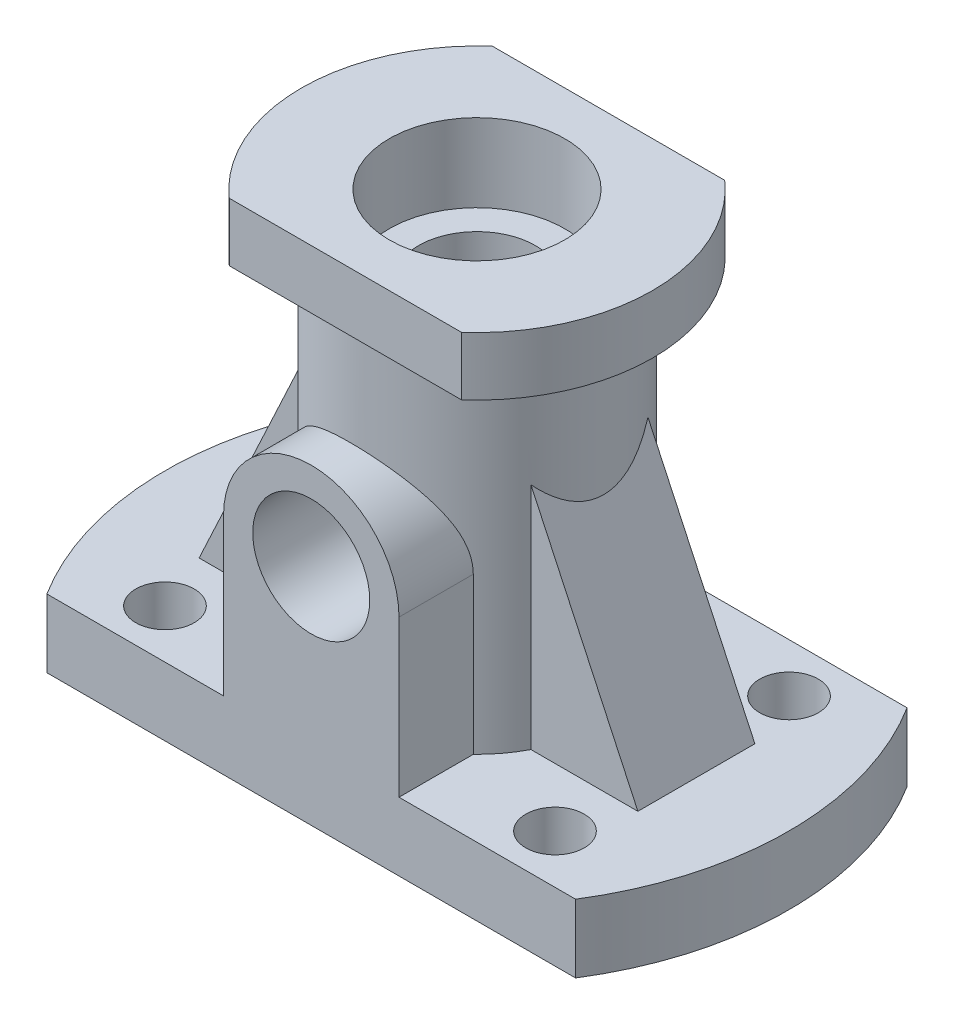
ISO-10303-21;
HEADER;
FILE_DESCRIPTION(('STEP AP214'),'2;1');
FILE_NAME('part.step','',(''),(''),'','','');
FILE_SCHEMA(('AUTOMOTIVE_DESIGN { 1 0 10303 214 1 1 1 1 }'));
ENDSEC;
DATA;
#1=APPLICATION_CONTEXT('core data for automotive mechanical design processes');
#2=APPLICATION_PROTOCOL_DEFINITION('international standard','automotive_design',2000,#1);
#3=PRODUCT_CONTEXT('',#1,'mechanical');
#4=PRODUCT('Part','Part','',(#3));
#5=PRODUCT_RELATED_PRODUCT_CATEGORY('part','',(#4));
#6=PRODUCT_DEFINITION_FORMATION('','',#4);
#7=PRODUCT_DEFINITION_CONTEXT('part definition',#1,'design');
#8=PRODUCT_DEFINITION('design','',#6,#7);
#9=PRODUCT_DEFINITION_SHAPE('','',#8);
#10=(LENGTH_UNIT() NAMED_UNIT(*) SI_UNIT(.MILLI.,.METRE.));
#11=(NAMED_UNIT(*) PLANE_ANGLE_UNIT() SI_UNIT($,.RADIAN.));
#12=(NAMED_UNIT(*) SI_UNIT($,.STERADIAN.) SOLID_ANGLE_UNIT());
#13=UNCERTAINTY_MEASURE_WITH_UNIT(LENGTH_MEASURE(1.E-05),#10,'distance_accuracy_value','');
#14=(GEOMETRIC_REPRESENTATION_CONTEXT(3) GLOBAL_UNCERTAINTY_ASSIGNED_CONTEXT((#13)) GLOBAL_UNIT_ASSIGNED_CONTEXT((#10,
#11,#12)) REPRESENTATION_CONTEXT('',''));
#15=CARTESIAN_POINT('',(0.,0.,0.));
#16=DIRECTION('',(0.,0.,1.));
#17=DIRECTION('',(1.,0.,0.));
#18=AXIS2_PLACEMENT_3D('',#15,#16,#17);
#19=CARTESIAN_POINT('',(0.,7.,0.));
#20=DIRECTION('',(0.,1.,0.));
#21=DIRECTION('',(0.,0.,1.));
#22=AXIS2_PLACEMENT_3D('',#19,#20,#21);
#23=PLANE('',#22);
#24=CARTESIAN_POINT('',(20.,7.,-12.));
#25=DIRECTION('',(0.,1.,0.));
#26=DIRECTION('',(0.,0.,-1.));
#27=AXIS2_PLACEMENT_3D('',#24,#25,#26);
#28=CIRCLE('',#27,3.);
#29=CARTESIAN_POINT('',(20.,7.,-15.));
#30=VERTEX_POINT('',#29);
#31=EDGE_CURVE('E376',#30,#30,#28,.T.);
#32=ORIENTED_EDGE('',*,*,#31,.F.);
#33=EDGE_LOOP('',(#32));
#34=FACE_BOUND('',#33,.T.);
#35=CARTESIAN_POINT('',(-20.,7.,-12.));
#36=DIRECTION('',(0.,-1.,0.));
#37=DIRECTION('',(0.,0.,-1.));
#38=AXIS2_PLACEMENT_3D('',#35,#36,#37);
#39=CIRCLE('',#38,3.);
#40=CARTESIAN_POINT('',(-20.,7.,-15.));
#41=VERTEX_POINT('',#40);
#42=EDGE_CURVE('E702',#41,#41,#39,.T.);
#43=ORIENTED_EDGE('',*,*,#42,.T.);
#44=EDGE_LOOP('',(#43));
#45=FACE_BOUND('',#44,.T.);
#46=CARTESIAN_POINT('',(20.,7.,12.));
#47=DIRECTION('',(0.,-1.,0.));
#48=DIRECTION('',(0.,0.,1.));
#49=AXIS2_PLACEMENT_3D('',#46,#47,#48);
#50=CIRCLE('',#49,3.);
#51=CARTESIAN_POINT('',(20.,7.,15.));
#52=VERTEX_POINT('',#51);
#53=EDGE_CURVE('E463',#52,#52,#50,.T.);
#54=ORIENTED_EDGE('',*,*,#53,.T.);
#55=EDGE_LOOP('',(#54));
#56=FACE_BOUND('',#55,.T.);
#57=CARTESIAN_POINT('',(-20.,7.,12.));
#58=DIRECTION('',(0.,1.,0.));
#59=DIRECTION('',(0.,0.,1.));
#60=AXIS2_PLACEMENT_3D('',#57,#58,#59);
#61=CIRCLE('',#60,3.);
#62=CARTESIAN_POINT('',(-20.,7.,15.));
#63=VERTEX_POINT('',#62);
#64=EDGE_CURVE('E458',#63,#63,#61,.T.);
#65=ORIENTED_EDGE('',*,*,#64,.F.);
#66=EDGE_LOOP('',(#65));
#67=FACE_BOUND('',#66,.T.);
#68=CARTESIAN_POINT('',(0.,7.,0.));
#69=DIRECTION('',(0.,1.,0.));
#70=DIRECTION('',(0.,0.,1.));
#71=AXIS2_PLACEMENT_3D('',#68,#69,#70);
#72=CIRCLE('',#71,13.);
#73=CARTESIAN_POINT('',(11.5325625946708,7.,-6.));
#74=VERTEX_POINT('',#73);
#75=CARTESIAN_POINT('',(-11.5325625946708,7.,-6.));
#76=VERTEX_POINT('',#75);
#77=EDGE_CURVE('E372',#74,#76,#72,.T.);
#78=ORIENTED_EDGE('',*,*,#77,.F.);
#79=DIRECTION('',(-1.,0.,0.));
#80=VECTOR('',#79,1.);
#81=CARTESIAN_POINT('',(22.5,7.,-6.));
#82=LINE('',#81,#80);
#83=CARTESIAN_POINT('',(22.5,7.,-6.));
#84=VERTEX_POINT('',#83);
#85=EDGE_CURVE('E184',#84,#74,#82,.T.);
#86=ORIENTED_EDGE('',*,*,#85,.F.);
#87=DIRECTION('',(0.,0.,1.));
#88=VECTOR('',#87,1.);
#89=CARTESIAN_POINT('',(22.5,7.,-6.));
#90=LINE('',#89,#88);
#91=CARTESIAN_POINT('',(22.5,7.,6.));
#92=VERTEX_POINT('',#91);
#93=EDGE_CURVE('E169',#84,#92,#90,.T.);
#94=ORIENTED_EDGE('',*,*,#93,.T.);
#95=DIRECTION('',(-1.,0.,0.));
#96=VECTOR('',#95,1.);
#97=CARTESIAN_POINT('',(22.5,7.,6.));
#98=LINE('',#97,#96);
#99=CARTESIAN_POINT('',(11.5325625946708,7.,6.));
#100=VERTEX_POINT('',#99);
#101=EDGE_CURVE('E173',#92,#100,#98,.T.);
#102=ORIENTED_EDGE('',*,*,#101,.T.);
#103=CARTESIAN_POINT('',(9.,7.,9.38083151964686));
#104=VERTEX_POINT('',#103);
#105=EDGE_CURVE('E369',#104,#100,#72,.T.);
#106=ORIENTED_EDGE('',*,*,#105,.F.);
#107=DIRECTION('',(0.,0.,1.));
#108=VECTOR('',#107,1.);
#109=CARTESIAN_POINT('',(9.,7.,-17.002));
#110=LINE('',#109,#108);
#111=CARTESIAN_POINT('',(9.,7.,17.));
#112=VERTEX_POINT('',#111);
#113=EDGE_CURVE('E223',#104,#112,#110,.T.);
#114=ORIENTED_EDGE('',*,*,#113,.T.);
#115=DIRECTION('',(1.,0.,0.));
#116=VECTOR('',#115,1.);
#117=CARTESIAN_POINT('',(-27.1108834234519,7.,17.));
#118=LINE('',#117,#116);
#119=CARTESIAN_POINT('',(27.1108834234519,7.,17.));
#120=VERTEX_POINT('',#119);
#121=EDGE_CURVE('E468',#112,#120,#118,.T.);
#122=ORIENTED_EDGE('',*,*,#121,.T.);
#123=CARTESIAN_POINT('',(0.,7.,0.));
#124=DIRECTION('',(0.,1.,0.));
#125=DIRECTION('',(0.,0.,1.));
#126=AXIS2_PLACEMENT_3D('',#123,#124,#125);
#127=CIRCLE('',#126,32.);
#128=CARTESIAN_POINT('',(27.1108834234519,7.,-17.));
#129=VERTEX_POINT('',#128);
#130=EDGE_CURVE('E342',#120,#129,#127,.T.);
#131=ORIENTED_EDGE('',*,*,#130,.T.);
#132=DIRECTION('',(-1.,0.,0.));
#133=VECTOR('',#132,1.);
#134=CARTESIAN_POINT('',(-27.1108834234519,7.,-17.));
#135=LINE('',#134,#133);
#136=CARTESIAN_POINT('',(-27.1108834234519,7.,-17.));
#137=VERTEX_POINT('',#136);
#138=EDGE_CURVE('E355',#129,#137,#135,.T.);
#139=ORIENTED_EDGE('',*,*,#138,.T.);
#140=CARTESIAN_POINT('',(0.,7.,0.));
#141=DIRECTION('',(0.,1.,0.));
#142=DIRECTION('',(0.,0.,1.));
#143=AXIS2_PLACEMENT_3D('',#140,#141,#142);
#144=CIRCLE('',#143,32.);
#145=CARTESIAN_POINT('',(-27.1108834234519,7.,17.));
#146=VERTEX_POINT('',#145);
#147=EDGE_CURVE('E348',#137,#146,#144,.T.);
#148=ORIENTED_EDGE('',*,*,#147,.T.);
#149=CARTESIAN_POINT('',(-9.,7.,17.));
#150=VERTEX_POINT('',#149);
#151=EDGE_CURVE('E469',#146,#150,#118,.T.);
#152=ORIENTED_EDGE('',*,*,#151,.T.);
#153=DIRECTION('',(0.,0.,-1.));
#154=VECTOR('',#153,1.);
#155=CARTESIAN_POINT('',(-9.,7.,-17.002));
#156=LINE('',#155,#154);
#157=CARTESIAN_POINT('',(-9.,7.,9.38083151964686));
#158=VERTEX_POINT('',#157);
#159=EDGE_CURVE('E227',#150,#158,#156,.T.);
#160=ORIENTED_EDGE('',*,*,#159,.T.);
#161=CARTESIAN_POINT('',(-11.5325625946708,7.,6.));
#162=VERTEX_POINT('',#161);
#163=EDGE_CURVE('E374',#162,#158,#72,.T.);
#164=ORIENTED_EDGE('',*,*,#163,.F.);
#165=DIRECTION('',(1.,0.,0.));
#166=VECTOR('',#165,1.);
#167=CARTESIAN_POINT('',(-22.5,7.,6.));
#168=LINE('',#167,#166);
#169=CARTESIAN_POINT('',(-22.5,7.,6.));
#170=VERTEX_POINT('',#169);
#171=EDGE_CURVE('E60',#170,#162,#168,.T.);
#172=ORIENTED_EDGE('',*,*,#171,.F.);
#173=DIRECTION('',(0.,0.,1.));
#174=VECTOR('',#173,1.);
#175=CARTESIAN_POINT('',(-22.5,7.,-6.));
#176=LINE('',#175,#174);
#177=CARTESIAN_POINT('',(-22.5,7.,-6.));
#178=VERTEX_POINT('',#177);
#179=EDGE_CURVE('E197',#178,#170,#176,.T.);
#180=ORIENTED_EDGE('',*,*,#179,.F.);
#181=DIRECTION('',(1.,0.,0.));
#182=VECTOR('',#181,1.);
#183=CARTESIAN_POINT('',(-22.5,7.,-6.));
#184=LINE('',#183,#182);
#185=EDGE_CURVE('E194',#178,#76,#184,.T.);
#186=ORIENTED_EDGE('',*,*,#185,.T.);
#187=EDGE_LOOP('',(#78,#86,#94,#102,#106,#114,#122,#131,#139,#148,#152,#160,#164,#172,#180,#186));
#188=FACE_BOUND('',#187,.T.);
#189=ADVANCED_FACE('F37',(#34,#45,#56,#67,#188),#23,.T.);
#190=CARTESIAN_POINT('',(0.,42.,0.));
#191=DIRECTION('',(0.,-1.,0.));
#192=DIRECTION('',(0.,0.,-1.));
#193=AXIS2_PLACEMENT_3D('',#190,#191,#192);
#194=CYLINDRICAL_SURFACE('',#193,13.);
#195=CARTESIAN_POINT('',(0.,42.,0.));
#196=DIRECTION('',(0.,1.,0.));
#197=DIRECTION('',(0.,0.,1.));
#198=AXIS2_PLACEMENT_3D('',#195,#196,#197);
#199=CIRCLE('',#198,13.);
#200=CARTESIAN_POINT('',(0.,42.,13.));
#201=VERTEX_POINT('',#200);
#202=EDGE_CURVE('E371',#201,#201,#199,.T.);
#203=ORIENTED_EDGE('',*,*,#202,.F.);
#204=EDGE_LOOP('',(#203));
#205=FACE_BOUND('',#204,.T.);
#206=DIRECTION('',(0.,-1.,0.));
#207=VECTOR('',#206,1.);
#208=CARTESIAN_POINT('',(11.5325625946708,42.,-6.));
#209=LINE('',#208,#207);
#210=CARTESIAN_POINT('',(11.5325625946708,30.5197454159836,-6.));
#211=VERTEX_POINT('',#210);
#212=EDGE_CURVE('E11',#74,#211,#209,.F.);
#213=ORIENTED_EDGE('',*,*,#212,.F.);
#214=ORIENTED_EDGE('',*,*,#77,.T.);
#215=DIRECTION('',(0.,-1.,0.));
#216=VECTOR('',#215,1.);
#217=CARTESIAN_POINT('',(-11.5325625946708,42.,-6.));
#218=LINE('',#217,#216);
#219=CARTESIAN_POINT('',(-11.5325625946708,30.5197454159836,-6.));
#220=VERTEX_POINT('',#219);
#221=EDGE_CURVE('E363',#220,#76,#218,.T.);
#222=ORIENTED_EDGE('',*,*,#221,.F.);
#223=CARTESIAN_POINT('',(0.,55.2514057114645,0.));
#224=DIRECTION('',(-0.906307787036648,0.422618261740704,0.));
#225=DIRECTION('',(-0.422618261740704,-0.906307787036648,0.));
#226=AXIS2_PLACEMENT_3D('',#223,#224,#225);
#227=ELLIPSE('',#226,30.7606205809822,13.);
#228=CARTESIAN_POINT('',(-11.5325625946708,30.5197454159836,6.));
#229=VERTEX_POINT('',#228);
#230=EDGE_CURVE('E360',#220,#229,#227,.T.);
#231=ORIENTED_EDGE('',*,*,#230,.T.);
#232=DIRECTION('',(0.,-1.,0.));
#233=VECTOR('',#232,1.);
#234=CARTESIAN_POINT('',(-11.5325625946708,42.,6.));
#235=LINE('',#234,#233);
#236=EDGE_CURVE('E358',#229,#162,#235,.T.);
#237=ORIENTED_EDGE('',*,*,#236,.T.);
#238=ORIENTED_EDGE('',*,*,#163,.T.);
#239=DIRECTION('',(0.,-1.,0.));
#240=VECTOR('',#239,1.);
#241=CARTESIAN_POINT('',(-9.,42.,9.38083151964686));
#242=LINE('',#241,#240);
#243=CARTESIAN_POINT('',(-9.,23.,9.38083151964686));
#244=VERTEX_POINT('',#243);
#245=EDGE_CURVE('E222',#244,#158,#242,.T.);
#246=ORIENTED_EDGE('',*,*,#245,.F.);
#247=CARTESIAN_POINT('',(9.,23.,9.38083151964686));
#248=CARTESIAN_POINT('',(9.00000195551194,23.109281590863,9.3808257099244));
#249=CARTESIAN_POINT('',(8.99800899360825,23.2185439624175,9.38274213521519));
#250=CARTESIAN_POINT('',(8.9900579091309,23.4367797007814,9.3903622727786));
#251=CARTESIAN_POINT('',(8.98410024589008,23.5457530996018,9.39606554632351));
#252=CARTESIAN_POINT('',(8.96034474196165,23.87151493557,9.41874360903438));
#253=CARTESIAN_POINT('',(8.93666419500784,24.0875358163211,9.44128704880777));
#254=CARTESIAN_POINT('',(8.87447382886631,24.5131115491226,9.49976263371282));
#255=CARTESIAN_POINT('',(8.83612533575314,24.7227108484366,9.53554899145173));
#256=CARTESIAN_POINT('',(8.74530413131831,25.1364779137659,9.61891100850263));
#257=CARTESIAN_POINT('',(8.69282665967837,25.3406438236485,9.66649064076062));
#258=CARTESIAN_POINT('',(8.57490389625952,25.741234069921,9.77124281519534));
#259=CARTESIAN_POINT('',(8.50953777839024,25.9376973022298,9.82835647736648));
#260=CARTESIAN_POINT('',(8.36642586105673,26.32344087215,9.95046682567776));
#261=CARTESIAN_POINT('',(8.28868082966281,26.5127216545068,10.0154630226733));
#262=CARTESIAN_POINT('',(8.03734070978799,27.0703409407484,10.2199652818551));
#263=CARTESIAN_POINT('',(7.84592988373194,27.4274903208693,10.3687160605543));
#264=CARTESIAN_POINT('',(7.50863541089304,27.9674585322767,10.6133962963535));
#265=CARTESIAN_POINT('',(7.3768357609505,28.1611015098971,10.7056204905726));
#266=CARTESIAN_POINT('',(7.09897520940021,28.5370710791971,10.8918538235021));
#267=CARTESIAN_POINT('',(6.95291328416346,28.7193968570826,10.9858630899399));
#268=CARTESIAN_POINT('',(6.64692711418784,29.0723095998355,11.1736572379947));
#269=CARTESIAN_POINT('',(6.48699586896819,29.2428905577114,11.2674419814545));
#270=CARTESIAN_POINT('',(6.15370949500606,29.5716546118136,11.4528698100124));
#271=CARTESIAN_POINT('',(5.98035451098951,29.7298378416669,11.5445129181863));
#272=CARTESIAN_POINT('',(5.59144218585637,30.0576554486902,11.73841164456));
#273=CARTESIAN_POINT('',(5.37359691648463,30.2249954744972,11.8399823297032));
#274=CARTESIAN_POINT('',(4.92100887547879,30.540541819655,12.0351321535615));
#275=CARTESIAN_POINT('',(4.68626308715378,30.6887447098312,12.1287098590041));
#276=CARTESIAN_POINT('',(4.20134449187813,30.9640643577582,12.3050870557945));
#277=CARTESIAN_POINT('',(3.95119487188303,31.0912117944038,12.3879021901926));
#278=CARTESIAN_POINT('',(3.43677745845613,31.322741565789,12.5403521593611));
#279=CARTESIAN_POINT('',(3.17251569031232,31.4271335209218,12.6099925623948));
#280=CARTESIAN_POINT('',(2.70356685284894,31.5868997161352,12.7174034752232));
#281=CARTESIAN_POINT('',(2.50160340717035,31.6479363713446,12.7587319257392));
#282=CARTESIAN_POINT('',(2.09233338300936,31.7559639035567,12.8321989831048));
#283=CARTESIAN_POINT('',(1.88502792696471,31.8029577054557,12.864339503589));
#284=CARTESIAN_POINT('',(1.46648324581181,31.8822726544217,12.9187435720911));
#285=CARTESIAN_POINT('',(1.255246582934,31.9146030324491,12.9410133337758));
#286=CARTESIAN_POINT('',(0.830166009123639,31.964184798963,12.9752181499993));
#287=CARTESIAN_POINT('',(0.616322010714029,31.9814356801075,12.9871528568202));
#288=CARTESIAN_POINT('',(0.187217722492278,32.0006199324661,13.0004273316533));
#289=CARTESIAN_POINT('',(-0.0280444627712335,32.0025247295307,13.0017473352587));
#290=CARTESIAN_POINT('',(-0.457949855893778,31.990913227742,12.9937101433514));
#291=CARTESIAN_POINT('',(-0.672593066057432,31.9773969863801,12.9843529876444));
#292=CARTESIAN_POINT('',(-1.09970273772063,31.9351396178258,12.9551722125125));
#293=CARTESIAN_POINT('',(-1.31216866187516,31.9063948203397,12.9353460699199));
#294=CARTESIAN_POINT('',(-1.73336379307757,31.834088038531,12.8856673119349));
#295=CARTESIAN_POINT('',(-1.94209299351823,31.7905260280116,12.8558146788157));
#296=CARTESIAN_POINT('',(-2.35003550559374,31.6902535141929,12.7874622703602));
#297=CARTESIAN_POINT('',(-2.54935689942799,31.6338451751435,12.749161768409));
#298=CARTESIAN_POINT('',(-2.94211247406124,31.5080264883626,12.6642945909378));
#299=CARTESIAN_POINT('',(-3.13554456047183,31.4386115765204,12.6177250140343));
#300=CARTESIAN_POINT('',(-3.51549356594056,31.2875264071346,12.5171848095962));
#301=CARTESIAN_POINT('',(-3.70201244829317,31.2058596627887,12.463216304076));
#302=CARTESIAN_POINT('',(-4.06753685818808,31.0309535585355,12.348758699626));
#303=CARTESIAN_POINT('',(-4.2465396376266,30.9377100142822,12.2882672440704));
#304=CARTESIAN_POINT('',(-4.61602158168553,30.7293099745617,12.1546344322415));
#305=CARTESIAN_POINT('',(-4.80553832809482,30.612868791531,12.0808351665865));
#306=CARTESIAN_POINT('',(-5.17398936059498,30.3674191605768,11.9276847196055));
#307=CARTESIAN_POINT('',(-5.35291904518244,30.2384053116922,11.8483311564275));
#308=CARTESIAN_POINT('',(-5.69981637027411,29.9685310181206,11.6854114245313));
#309=CARTESIAN_POINT('',(-5.86777534375116,29.8276614035297,11.6018420154326));
#310=CARTESIAN_POINT('',(-6.19224456106073,29.5348203980515,11.431957495225));
#311=CARTESIAN_POINT('',(-6.34875364651582,29.3828478869916,11.3456421075714));
#312=CARTESIAN_POINT('',(-6.6764136188107,29.0407777396719,11.1564898135338));
#313=CARTESIAN_POINT('',(-6.84532621916435,28.8486651871741,11.0534076129591));
#314=CARTESIAN_POINT('',(-7.16641572878552,28.4504979498017,10.8479870365356));
#315=CARTESIAN_POINT('',(-7.31858910957648,28.2444403401638,10.7456488217418));
#316=CARTESIAN_POINT('',(-7.60553643363537,27.8188830062757,10.5445009375273));
#317=CARTESIAN_POINT('',(-7.74031137228791,27.5993840520803,10.4456910664802));
#318=CARTESIAN_POINT('',(-7.99153913734129,27.1475513822524,10.2547649559516));
#319=CARTESIAN_POINT('',(-8.10799821776645,26.9152220843643,10.1626464374876));
#320=CARTESIAN_POINT('',(-8.37594883000304,26.3164415024092,9.94417772623478));
#321=CARTESIAN_POINT('',(-8.51515524828115,25.9418459879001,9.82423006095672));
#322=CARTESIAN_POINT('',(-8.68668936681556,25.3626069794905,9.67198425621953));
#323=CARTESIAN_POINT('',(-8.73761413561111,25.1668931133167,9.62588888888996));
#324=CARTESIAN_POINT('',(-8.82649441159561,24.7703763684949,9.54445516025221));
#325=CARTESIAN_POINT('',(-8.86445517899175,24.5695755894974,9.50911243664287));
#326=CARTESIAN_POINT('',(-8.93005649492109,24.142585050387,9.44755876816322));
#327=CARTESIAN_POINT('',(-8.95618093455732,23.9159561855554,9.42270895524074));
#328=CARTESIAN_POINT('',(-8.98241701261064,23.5738836364075,9.39767590358811));
#329=CARTESIAN_POINT('',(-8.98900405178583,23.4593269959357,9.39137160742606));
#330=CARTESIAN_POINT('',(-8.99779746245776,23.2298546139967,9.38294519204893));
#331=CARTESIAN_POINT('',(-9.00000238102187,23.1149387660754,9.38082445993493));
#332=CARTESIAN_POINT('',(-9.,23.,9.38083151964686));
#333=B_SPLINE_CURVE_WITH_KNOTS('',3,(#247,#248,#249,#250,#251,#252,#253,#254,#255,#256,#257,
#258,#259,#260,#261,#262,#263,#264,#265,#266,#267,#268,#269,#270,#271,#272,#273,#274,#275,#276,
#277,#278,#279,#280,#281,#282,#283,#284,#285,#286,#287,#288,#289,#290,#291,#292,#293,#294,#295,
#296,#297,#298,#299,#300,#301,#302,#303,#304,#305,#306,#307,#308,#309,#310,#311,#312,#313,#314,
#315,#316,#317,#318,#319,#320,#321,#322,#323,#324,#325,#326,#327,#328,#329,#330,#331,#332),
.UNSPECIFIED.,.F.,.F.,(4,2,2,2,2,2,2,2,2,2,2,2,2,2,2,2,2,2,2,2,2,2,2,2,2,2,2,2,2,2,2,2,2,2,2,2,
2,2,2,2,2,2,4),(0.,0.327772404152453,0.655506840648773,1.30980863104586,1.9571118806618,
2.60463349240515,3.24829484557937,3.89191627726453,5.18226157804349,5.93697645954376,
6.69174554815042,7.44689784568076,8.20204200278952,9.07948301190049,9.95708103172238,
10.8333888748605,11.7093255174423,12.3536499645513,12.9978401157488,13.6416241697261,
14.2854298826545,14.9304340745436,15.5754358617885,16.220593174203,16.8657516272622,
17.4970677330642,18.1286057890464,18.7599630971965,19.3915492726127,20.0939252077021,
20.7966042105069,21.499831788749,22.2031304139446,23.0296378155787,23.8563191050121,
24.6829530780913,25.5093041779424,26.755716357767,27.3773621908184,27.9987554874993,
28.685868850405,29.0304857002905,29.3752167920314),.UNSPECIFIED.);
#334=CARTESIAN_POINT('',(9.,23.,9.38083151964686));
#335=VERTEX_POINT('',#334);
#336=EDGE_CURVE('E230',#335,#244,#333,.T.);
#337=ORIENTED_EDGE('',*,*,#336,.F.);
#338=DIRECTION('',(0.,-1.,0.));
#339=VECTOR('',#338,1.);
#340=CARTESIAN_POINT('',(9.,42.,9.38083151964686));
#341=LINE('',#340,#339);
#342=EDGE_CURVE('E220',#104,#335,#341,.F.);
#343=ORIENTED_EDGE('',*,*,#342,.F.);
#344=ORIENTED_EDGE('',*,*,#105,.T.);
#345=DIRECTION('',(0.,-1.,0.));
#346=VECTOR('',#345,1.);
#347=CARTESIAN_POINT('',(11.5325625946708,42.,6.));
#348=LINE('',#347,#346);
#349=CARTESIAN_POINT('',(11.5325625946708,30.5197454159836,6.));
#350=VERTEX_POINT('',#349);
#351=EDGE_CURVE('E177',#100,#350,#348,.F.);
#352=ORIENTED_EDGE('',*,*,#351,.T.);
#353=CARTESIAN_POINT('',(0.,55.2514057114645,0.));
#354=DIRECTION('',(-0.906307787036648,-0.422618261740704,0.));
#355=DIRECTION('',(0.422618261740704,-0.906307787036648,0.));
#356=AXIS2_PLACEMENT_3D('',#353,#354,#355);
#357=ELLIPSE('',#356,30.7606205809822,13.);
#358=EDGE_CURVE('E45',#211,#350,#357,.T.);
#359=ORIENTED_EDGE('',*,*,#358,.F.);
#360=EDGE_LOOP('',(#213,#214,#222,#231,#237,#238,#246,#337,#343,#344,#352,#359));
#361=FACE_BOUND('',#360,.T.);
#362=ADVANCED_FACE('F282',(#205,#361),#194,.T.);
#363=CARTESIAN_POINT('',(0.,7.,0.));
#364=DIRECTION('',(0.,-1.,0.));
#365=DIRECTION('',(0.,0.,-1.));
#366=AXIS2_PLACEMENT_3D('',#363,#364,#365);
#367=CYLINDRICAL_SURFACE('',#366,32.);
#368=CARTESIAN_POINT('',(0.,0.,0.));
#369=DIRECTION('',(0.,1.,0.));
#370=DIRECTION('',(0.,0.,1.));
#371=AXIS2_PLACEMENT_3D('',#368,#369,#370);
#372=CIRCLE('',#371,32.);
#373=CARTESIAN_POINT('',(-27.1108834234519,0.,-17.));
#374=VERTEX_POINT('',#373);
#375=CARTESIAN_POINT('',(-27.1108834234519,0.,17.));
#376=VERTEX_POINT('',#375);
#377=EDGE_CURVE('E338',#374,#376,#372,.T.);
#378=ORIENTED_EDGE('',*,*,#377,.T.);
#379=DIRECTION('',(0.,-1.,0.));
#380=VECTOR('',#379,1.);
#381=CARTESIAN_POINT('',(-27.1108834234519,7.,17.));
#382=LINE('',#381,#380);
#383=EDGE_CURVE('E332',#146,#376,#382,.T.);
#384=ORIENTED_EDGE('',*,*,#383,.F.);
#385=ORIENTED_EDGE('',*,*,#147,.F.);
#386=DIRECTION('',(0.,-1.,0.));
#387=VECTOR('',#386,1.);
#388=CARTESIAN_POINT('',(-27.1108834234519,7.,-17.));
#389=LINE('',#388,#387);
#390=EDGE_CURVE('E352',#137,#374,#389,.T.);
#391=ORIENTED_EDGE('',*,*,#390,.T.);
#392=EDGE_LOOP('',(#378,#384,#385,#391));
#393=FACE_BOUND('',#392,.T.);
#394=ADVANCED_FACE('F39',(#393),#367,.T.);
#395=CARTESIAN_POINT('',(-27.1108834234519,7.,17.));
#396=DIRECTION('',(0.,0.,-1.));
#397=DIRECTION('',(-1.,0.,0.));
#398=AXIS2_PLACEMENT_3D('',#395,#396,#397);
#399=PLANE('',#398);
#400=CARTESIAN_POINT('',(0.,23.,17.));
#401=DIRECTION('',(0.,0.,1.));
#402=DIRECTION('',(1.,0.,0.));
#403=AXIS2_PLACEMENT_3D('',#400,#401,#402);
#404=CIRCLE('',#403,6.);
#405=CARTESIAN_POINT('',(6.,23.,17.));
#406=VERTEX_POINT('',#405);
#407=EDGE_CURVE('E203',#406,#406,#404,.T.);
#408=ORIENTED_EDGE('',*,*,#407,.F.);
#409=EDGE_LOOP('',(#408));
#410=FACE_BOUND('',#409,.T.);
#411=DIRECTION('',(1.,0.,0.));
#412=VECTOR('',#411,1.);
#413=CARTESIAN_POINT('',(-27.1108834234519,0.,17.));
#414=LINE('',#413,#412);
#415=CARTESIAN_POINT('',(27.1108834234519,0.,17.));
#416=VERTEX_POINT('',#415);
#417=EDGE_CURVE('E326',#376,#416,#414,.T.);
#418=ORIENTED_EDGE('',*,*,#417,.T.);
#419=DIRECTION('',(0.,-1.,0.));
#420=VECTOR('',#419,1.);
#421=CARTESIAN_POINT('',(27.1108834234519,7.,17.));
#422=LINE('',#421,#420);
#423=EDGE_CURVE('E329',#120,#416,#422,.T.);
#424=ORIENTED_EDGE('',*,*,#423,.F.);
#425=ORIENTED_EDGE('',*,*,#121,.F.);
#426=DIRECTION('',(0.,1.,0.));
#427=VECTOR('',#426,1.);
#428=CARTESIAN_POINT('',(9.,0.,17.));
#429=LINE('',#428,#427);
#430=CARTESIAN_POINT('',(9.,23.,17.));
#431=VERTEX_POINT('',#430);
#432=EDGE_CURVE('E211',#112,#431,#429,.T.);
#433=ORIENTED_EDGE('',*,*,#432,.T.);
#434=CARTESIAN_POINT('',(0.,23.,17.));
#435=DIRECTION('',(0.,0.,1.));
#436=DIRECTION('',(1.,0.,0.));
#437=AXIS2_PLACEMENT_3D('',#434,#435,#436);
#438=CIRCLE('',#437,9.);
#439=CARTESIAN_POINT('',(-9.,23.,17.));
#440=VERTEX_POINT('',#439);
#441=EDGE_CURVE('E207',#431,#440,#438,.T.);
#442=ORIENTED_EDGE('',*,*,#441,.T.);
#443=DIRECTION('',(0.,-1.,0.));
#444=VECTOR('',#443,1.);
#445=CARTESIAN_POINT('',(-9.,23.,17.));
#446=LINE('',#445,#444);
#447=EDGE_CURVE('E208',#440,#150,#446,.T.);
#448=ORIENTED_EDGE('',*,*,#447,.T.);
#449=ORIENTED_EDGE('',*,*,#151,.F.);
#450=ORIENTED_EDGE('',*,*,#383,.T.);
#451=EDGE_LOOP('',(#418,#424,#425,#433,#442,#448,#449,#450));
#452=FACE_BOUND('',#451,.T.);
#453=ADVANCED_FACE('F314',(#410,#452),#399,.F.);
#454=CARTESIAN_POINT('',(0.,7.,0.));
#455=DIRECTION('',(0.,-1.,0.));
#456=DIRECTION('',(0.,0.,-1.));
#457=AXIS2_PLACEMENT_3D('',#454,#455,#456);
#458=CYLINDRICAL_SURFACE('',#457,32.);
#459=CARTESIAN_POINT('',(0.,0.,0.));
#460=DIRECTION('',(0.,1.,0.));
#461=DIRECTION('',(0.,0.,1.));
#462=AXIS2_PLACEMENT_3D('',#459,#460,#461);
#463=CIRCLE('',#462,32.);
#464=CARTESIAN_POINT('',(27.1108834234519,0.,-17.));
#465=VERTEX_POINT('',#464);
#466=EDGE_CURVE('E337',#416,#465,#463,.T.);
#467=ORIENTED_EDGE('',*,*,#466,.T.);
#468=DIRECTION('',(0.,-1.,0.));
#469=VECTOR('',#468,1.);
#470=CARTESIAN_POINT('',(27.1108834234519,7.,-17.));
#471=LINE('',#470,#469);
#472=EDGE_CURVE('E343',#129,#465,#471,.T.);
#473=ORIENTED_EDGE('',*,*,#472,.F.);
#474=ORIENTED_EDGE('',*,*,#130,.F.);
#475=ORIENTED_EDGE('',*,*,#423,.T.);
#476=EDGE_LOOP('',(#467,#473,#474,#475));
#477=FACE_BOUND('',#476,.T.);
#478=ADVANCED_FACE('F311',(#477),#458,.T.);
#479=CARTESIAN_POINT('',(-27.1108834234519,7.,-17.));
#480=DIRECTION('',(0.,0.,1.));
#481=DIRECTION('',(1.,0.,0.));
#482=AXIS2_PLACEMENT_3D('',#479,#480,#481);
#483=PLANE('',#482);
#484=DIRECTION('',(-1.,0.,0.));
#485=VECTOR('',#484,1.);
#486=CARTESIAN_POINT('',(-27.1108834234519,0.,-17.));
#487=LINE('',#486,#485);
#488=EDGE_CURVE('E346',#465,#374,#487,.T.);
#489=ORIENTED_EDGE('',*,*,#488,.T.);
#490=ORIENTED_EDGE('',*,*,#390,.F.);
#491=ORIENTED_EDGE('',*,*,#138,.F.);
#492=ORIENTED_EDGE('',*,*,#472,.T.);
#493=EDGE_LOOP('',(#489,#490,#491,#492));
#494=FACE_BOUND('',#493,.T.);
#495=ADVANCED_FACE('F307',(#494),#483,.F.);
#496=CARTESIAN_POINT('',(0.,0.,0.));
#497=DIRECTION('',(0.,1.,0.));
#498=DIRECTION('',(0.,0.,1.));
#499=AXIS2_PLACEMENT_3D('',#496,#497,#498);
#500=PLANE('',#499);
#501=CARTESIAN_POINT('',(0.,0.,0.));
#502=DIRECTION('',(0.,1.,0.));
#503=DIRECTION('',(0.,0.,1.));
#504=AXIS2_PLACEMENT_3D('',#501,#502,#503);
#505=CIRCLE('',#504,6.);
#506=CARTESIAN_POINT('',(0.,0.,6.));
#507=VERTEX_POINT('',#506);
#508=EDGE_CURVE('E418',#507,#507,#505,.T.);
#509=ORIENTED_EDGE('',*,*,#508,.T.);
#510=EDGE_LOOP('',(#509));
#511=FACE_BOUND('',#510,.T.);
#512=CARTESIAN_POINT('',(20.,0.,-12.));
#513=DIRECTION('',(0.,1.,0.));
#514=DIRECTION('',(0.,0.,-1.));
#515=AXIS2_PLACEMENT_3D('',#512,#513,#514);
#516=CIRCLE('',#515,3.);
#517=CARTESIAN_POINT('',(20.,0.,-15.));
#518=VERTEX_POINT('',#517);
#519=EDGE_CURVE('E446',#518,#518,#516,.T.);
#520=ORIENTED_EDGE('',*,*,#519,.T.);
#521=EDGE_LOOP('',(#520));
#522=FACE_BOUND('',#521,.T.);
#523=CARTESIAN_POINT('',(-20.,0.,-12.));
#524=DIRECTION('',(0.,-1.,0.));
#525=DIRECTION('',(0.,0.,-1.));
#526=AXIS2_PLACEMENT_3D('',#523,#524,#525);
#527=CIRCLE('',#526,3.);
#528=CARTESIAN_POINT('',(-20.,0.,-15.));
#529=VERTEX_POINT('',#528);
#530=EDGE_CURVE('E450',#529,#529,#527,.T.);
#531=ORIENTED_EDGE('',*,*,#530,.F.);
#532=EDGE_LOOP('',(#531));
#533=FACE_BOUND('',#532,.T.);
#534=CARTESIAN_POINT('',(20.,0.,12.));
#535=DIRECTION('',(0.,-1.,0.));
#536=DIRECTION('',(0.,0.,1.));
#537=AXIS2_PLACEMENT_3D('',#534,#535,#536);
#538=CIRCLE('',#537,3.);
#539=CARTESIAN_POINT('',(20.,0.,15.));
#540=VERTEX_POINT('',#539);
#541=EDGE_CURVE('E454',#540,#540,#538,.T.);
#542=ORIENTED_EDGE('',*,*,#541,.F.);
#543=EDGE_LOOP('',(#542));
#544=FACE_BOUND('',#543,.T.);
#545=CARTESIAN_POINT('',(-20.,0.,12.));
#546=DIRECTION('',(0.,1.,0.));
#547=DIRECTION('',(0.,0.,1.));
#548=AXIS2_PLACEMENT_3D('',#545,#546,#547);
#549=CIRCLE('',#548,3.);
#550=CARTESIAN_POINT('',(-20.,0.,15.));
#551=VERTEX_POINT('',#550);
#552=EDGE_CURVE('E457',#551,#551,#549,.T.);
#553=ORIENTED_EDGE('',*,*,#552,.T.);
#554=EDGE_LOOP('',(#553));
#555=FACE_BOUND('',#554,.T.);
#556=ORIENTED_EDGE('',*,*,#377,.F.);
#557=ORIENTED_EDGE('',*,*,#488,.F.);
#558=ORIENTED_EDGE('',*,*,#466,.F.);
#559=ORIENTED_EDGE('',*,*,#417,.F.);
#560=EDGE_LOOP('',(#556,#557,#558,#559));
#561=FACE_BOUND('',#560,.T.);
#562=ADVANCED_FACE('F300',(#511,#522,#533,#544,#555,#561),#500,.F.);
#563=CARTESIAN_POINT('',(-20.,0.,12.));
#564=DIRECTION('',(0.,1.,0.));
#565=DIRECTION('',(0.,0.,1.));
#566=AXIS2_PLACEMENT_3D('',#563,#564,#565);
#567=CYLINDRICAL_SURFACE('',#566,3.);
#568=ORIENTED_EDGE('',*,*,#552,.F.);
#569=EDGE_LOOP('',(#568));
#570=FACE_BOUND('',#569,.T.);
#571=ORIENTED_EDGE('',*,*,#64,.T.);
#572=EDGE_LOOP('',(#571));
#573=FACE_BOUND('',#572,.T.);
#574=ADVANCED_FACE('F296',(#570,#573),#567,.F.);
#575=CARTESIAN_POINT('',(20.,0.,12.));
#576=DIRECTION('',(0.,1.,0.));
#577=DIRECTION('',(0.,0.,1.));
#578=AXIS2_PLACEMENT_3D('',#575,#576,#577);
#579=CYLINDRICAL_SURFACE('',#578,3.);
#580=ORIENTED_EDGE('',*,*,#541,.T.);
#581=EDGE_LOOP('',(#580));
#582=FACE_BOUND('',#581,.T.);
#583=ORIENTED_EDGE('',*,*,#53,.F.);
#584=EDGE_LOOP('',(#583));
#585=FACE_BOUND('',#584,.T.);
#586=ADVANCED_FACE('F292',(#582,#585),#579,.F.);
#587=CARTESIAN_POINT('',(-20.,0.,-12.));
#588=DIRECTION('',(0.,1.,0.));
#589=DIRECTION('',(0.,0.,1.));
#590=AXIS2_PLACEMENT_3D('',#587,#588,#589);
#591=CYLINDRICAL_SURFACE('',#590,3.);
#592=ORIENTED_EDGE('',*,*,#530,.T.);
#593=EDGE_LOOP('',(#592));
#594=FACE_BOUND('',#593,.T.);
#595=ORIENTED_EDGE('',*,*,#42,.F.);
#596=EDGE_LOOP('',(#595));
#597=FACE_BOUND('',#596,.T.);
#598=ADVANCED_FACE('F288',(#594,#597),#591,.F.);
#599=CARTESIAN_POINT('',(20.,0.,-12.));
#600=DIRECTION('',(0.,1.,0.));
#601=DIRECTION('',(0.,0.,1.));
#602=AXIS2_PLACEMENT_3D('',#599,#600,#601);
#603=CYLINDRICAL_SURFACE('',#602,3.);
#604=ORIENTED_EDGE('',*,*,#519,.F.);
#605=EDGE_LOOP('',(#604));
#606=FACE_BOUND('',#605,.T.);
#607=ORIENTED_EDGE('',*,*,#31,.T.);
#608=EDGE_LOOP('',(#607));
#609=FACE_BOUND('',#608,.T.);
#610=ADVANCED_FACE('F280',(#606,#609),#603,.F.);
#611=CARTESIAN_POINT('',(0.,48.,0.));
#612=DIRECTION('',(0.,-1.,0.));
#613=DIRECTION('',(0.,0.,-1.));
#614=AXIS2_PLACEMENT_3D('',#611,#612,#613);
#615=CYLINDRICAL_SURFACE('',#614,18.);
#616=CARTESIAN_POINT('',(0.,42.,0.));
#617=DIRECTION('',(0.,1.,0.));
#618=DIRECTION('',(0.,0.,1.));
#619=AXIS2_PLACEMENT_3D('',#616,#617,#618);
#620=CIRCLE('',#619,18.);
#621=CARTESIAN_POINT('',(-11.9058808997907,42.,-13.5));
#622=VERTEX_POINT('',#621);
#623=CARTESIAN_POINT('',(-11.9058808997906,42.,13.5));
#624=VERTEX_POINT('',#623);
#625=EDGE_CURVE('E405',#622,#624,#620,.T.);
#626=ORIENTED_EDGE('',*,*,#625,.T.);
#627=DIRECTION('',(0.,-1.,0.));
#628=VECTOR('',#627,1.);
#629=CARTESIAN_POINT('',(-11.9058808997906,48.,13.5));
#630=LINE('',#629,#628);
#631=CARTESIAN_POINT('',(-11.9058808997906,48.,13.5));
#632=VERTEX_POINT('',#631);
#633=EDGE_CURVE('E379',#632,#624,#630,.T.);
#634=ORIENTED_EDGE('',*,*,#633,.F.);
#635=CARTESIAN_POINT('',(0.,48.,0.));
#636=DIRECTION('',(0.,1.,0.));
#637=DIRECTION('',(0.,0.,1.));
#638=AXIS2_PLACEMENT_3D('',#635,#636,#637);
#639=CIRCLE('',#638,18.);
#640=CARTESIAN_POINT('',(-11.9058808997907,48.,-13.5));
#641=VERTEX_POINT('',#640);
#642=EDGE_CURVE('E400',#641,#632,#639,.T.);
#643=ORIENTED_EDGE('',*,*,#642,.F.);
#644=DIRECTION('',(0.,-1.,0.));
#645=VECTOR('',#644,1.);
#646=CARTESIAN_POINT('',(-11.9058808997907,48.,-13.5));
#647=LINE('',#646,#645);
#648=EDGE_CURVE('E394',#641,#622,#647,.T.);
#649=ORIENTED_EDGE('',*,*,#648,.T.);
#650=EDGE_LOOP('',(#626,#634,#643,#649));
#651=FACE_BOUND('',#650,.T.);
#652=ADVANCED_FACE('F276',(#651),#615,.T.);
#653=CARTESIAN_POINT('',(11.9058808997906,48.,13.5));
#654=DIRECTION('',(0.,0.,-1.));
#655=DIRECTION('',(-1.,0.,0.));
#656=AXIS2_PLACEMENT_3D('',#653,#654,#655);
#657=PLANE('',#656);
#658=DIRECTION('',(1.,0.,0.));
#659=VECTOR('',#658,1.);
#660=CARTESIAN_POINT('',(11.9058808997906,42.,13.5));
#661=LINE('',#660,#659);
#662=CARTESIAN_POINT('',(11.9058808997906,42.,13.5));
#663=VERTEX_POINT('',#662);
#664=EDGE_CURVE('E403',#624,#663,#661,.T.);
#665=ORIENTED_EDGE('',*,*,#664,.T.);
#666=DIRECTION('',(0.,-1.,0.));
#667=VECTOR('',#666,1.);
#668=CARTESIAN_POINT('',(11.9058808997906,48.,13.5));
#669=LINE('',#668,#667);
#670=CARTESIAN_POINT('',(11.9058808997906,48.,13.5));
#671=VERTEX_POINT('',#670);
#672=EDGE_CURVE('E384',#671,#663,#669,.T.);
#673=ORIENTED_EDGE('',*,*,#672,.F.);
#674=DIRECTION('',(1.,0.,0.));
#675=VECTOR('',#674,1.);
#676=CARTESIAN_POINT('',(11.9058808997906,48.,13.5));
#677=LINE('',#676,#675);
#678=EDGE_CURVE('E411',#632,#671,#677,.T.);
#679=ORIENTED_EDGE('',*,*,#678,.F.);
#680=ORIENTED_EDGE('',*,*,#633,.T.);
#681=EDGE_LOOP('',(#665,#673,#679,#680));
#682=FACE_BOUND('',#681,.T.);
#683=ADVANCED_FACE('F272',(#682),#657,.F.);
#684=CARTESIAN_POINT('',(0.,48.,0.));
#685=DIRECTION('',(0.,-1.,0.));
#686=DIRECTION('',(0.,0.,-1.));
#687=AXIS2_PLACEMENT_3D('',#684,#685,#686);
#688=CYLINDRICAL_SURFACE('',#687,18.);
#689=CARTESIAN_POINT('',(0.,42.,0.));
#690=DIRECTION('',(0.,1.,0.));
#691=DIRECTION('',(0.,0.,1.));
#692=AXIS2_PLACEMENT_3D('',#689,#690,#691);
#693=CIRCLE('',#692,18.);
#694=CARTESIAN_POINT('',(11.9058808997907,42.,-13.5));
#695=VERTEX_POINT('',#694);
#696=EDGE_CURVE('E401',#663,#695,#693,.T.);
#697=ORIENTED_EDGE('',*,*,#696,.T.);
#698=DIRECTION('',(0.,-1.,0.));
#699=VECTOR('',#698,1.);
#700=CARTESIAN_POINT('',(11.9058808997907,48.,-13.5));
#701=LINE('',#700,#699);
#702=CARTESIAN_POINT('',(11.9058808997907,48.,-13.5));
#703=VERTEX_POINT('',#702);
#704=EDGE_CURVE('E389',#703,#695,#701,.T.);
#705=ORIENTED_EDGE('',*,*,#704,.F.);
#706=CARTESIAN_POINT('',(0.,48.,0.));
#707=DIRECTION('',(0.,1.,0.));
#708=DIRECTION('',(0.,0.,1.));
#709=AXIS2_PLACEMENT_3D('',#706,#707,#708);
#710=CIRCLE('',#709,18.);
#711=EDGE_CURVE('E409',#671,#703,#710,.T.);
#712=ORIENTED_EDGE('',*,*,#711,.F.);
#713=ORIENTED_EDGE('',*,*,#672,.T.);
#714=EDGE_LOOP('',(#697,#705,#712,#713));
#715=FACE_BOUND('',#714,.T.);
#716=ADVANCED_FACE('F268',(#715),#688,.T.);
#717=CARTESIAN_POINT('',(-11.9058808997907,48.,-13.5));
#718=DIRECTION('',(0.,0.,1.));
#719=DIRECTION('',(1.,0.,0.));
#720=AXIS2_PLACEMENT_3D('',#717,#718,#719);
#721=PLANE('',#720);
#722=DIRECTION('',(-1.,0.,0.));
#723=VECTOR('',#722,1.);
#724=CARTESIAN_POINT('',(-11.9058808997907,42.,-13.5));
#725=LINE('',#724,#723);
#726=EDGE_CURVE('E398',#695,#622,#725,.T.);
#727=ORIENTED_EDGE('',*,*,#726,.T.);
#728=ORIENTED_EDGE('',*,*,#648,.F.);
#729=DIRECTION('',(-1.,0.,0.));
#730=VECTOR('',#729,1.);
#731=CARTESIAN_POINT('',(-11.9058808997907,48.,-13.5));
#732=LINE('',#731,#730);
#733=EDGE_CURVE('E397',#703,#641,#732,.T.);
#734=ORIENTED_EDGE('',*,*,#733,.F.);
#735=ORIENTED_EDGE('',*,*,#704,.T.);
#736=EDGE_LOOP('',(#727,#728,#734,#735));
#737=FACE_BOUND('',#736,.T.);
#738=ADVANCED_FACE('F261',(#737),#721,.F.);
#739=CARTESIAN_POINT('',(0.,48.,0.));
#740=DIRECTION('',(0.,1.,0.));
#741=DIRECTION('',(0.,0.,1.));
#742=AXIS2_PLACEMENT_3D('',#739,#740,#741);
#743=PLANE('',#742);
#744=CARTESIAN_POINT('',(0.,48.,0.));
#745=DIRECTION('',(0.,1.,0.));
#746=DIRECTION('',(0.,0.,1.));
#747=AXIS2_PLACEMENT_3D('',#744,#745,#746);
#748=CIRCLE('',#747,9.);
#749=CARTESIAN_POINT('',(0.,48.,9.));
#750=VERTEX_POINT('',#749);
#751=EDGE_CURVE('E415',#750,#750,#748,.T.);
#752=ORIENTED_EDGE('',*,*,#751,.F.);
#753=EDGE_LOOP('',(#752));
#754=FACE_BOUND('',#753,.T.);
#755=ORIENTED_EDGE('',*,*,#642,.T.);
#756=ORIENTED_EDGE('',*,*,#678,.T.);
#757=ORIENTED_EDGE('',*,*,#711,.T.);
#758=ORIENTED_EDGE('',*,*,#733,.T.);
#759=EDGE_LOOP('',(#755,#756,#757,#758));
#760=FACE_BOUND('',#759,.T.);
#761=ADVANCED_FACE('F258',(#754,#760),#743,.T.);
#762=CARTESIAN_POINT('',(0.,42.,0.));
#763=DIRECTION('',(0.,1.,0.));
#764=DIRECTION('',(0.,0.,1.));
#765=AXIS2_PLACEMENT_3D('',#762,#763,#764);
#766=PLANE('',#765);
#767=ORIENTED_EDGE('',*,*,#202,.T.);
#768=EDGE_LOOP('',(#767));
#769=FACE_BOUND('',#768,.T.);
#770=ORIENTED_EDGE('',*,*,#625,.F.);
#771=ORIENTED_EDGE('',*,*,#726,.F.);
#772=ORIENTED_EDGE('',*,*,#696,.F.);
#773=ORIENTED_EDGE('',*,*,#664,.F.);
#774=EDGE_LOOP('',(#770,#771,#772,#773));
#775=FACE_BOUND('',#774,.T.);
#776=ADVANCED_FACE('F256',(#769,#775),#766,.F.);
#777=CARTESIAN_POINT('',(0.,40.,0.));
#778=DIRECTION('',(0.,1.,0.));
#779=DIRECTION('',(0.,0.,1.));
#780=AXIS2_PLACEMENT_3D('',#777,#778,#779);
#781=CYLINDRICAL_SURFACE('',#780,9.);
#782=CARTESIAN_POINT('',(0.,40.,0.));
#783=DIRECTION('',(0.,1.,0.));
#784=DIRECTION('',(0.,0.,1.));
#785=AXIS2_PLACEMENT_3D('',#782,#783,#784);
#786=CIRCLE('',#785,9.);
#787=CARTESIAN_POINT('',(0.,40.,9.));
#788=VERTEX_POINT('',#787);
#789=EDGE_CURVE('E407',#788,#788,#786,.T.);
#790=ORIENTED_EDGE('',*,*,#789,.F.);
#791=EDGE_LOOP('',(#790));
#792=FACE_BOUND('',#791,.T.);
#793=ORIENTED_EDGE('',*,*,#751,.T.);
#794=EDGE_LOOP('',(#793));
#795=FACE_BOUND('',#794,.T.);
#796=ADVANCED_FACE('F252',(#792,#795),#781,.F.);
#797=CARTESIAN_POINT('',(0.,40.,0.));
#798=DIRECTION('',(0.,1.,0.));
#799=DIRECTION('',(0.,0.,1.));
#800=AXIS2_PLACEMENT_3D('',#797,#798,#799);
#801=PLANE('',#800);
#802=CARTESIAN_POINT('',(0.,40.,0.));
#803=DIRECTION('',(0.,1.,0.));
#804=DIRECTION('',(0.,0.,1.));
#805=AXIS2_PLACEMENT_3D('',#802,#803,#804);
#806=CIRCLE('',#805,6.);
#807=CARTESIAN_POINT('',(0.,40.,6.));
#808=VERTEX_POINT('',#807);
#809=EDGE_CURVE('E226',#808,#808,#806,.T.);
#810=ORIENTED_EDGE('',*,*,#809,.F.);
#811=EDGE_LOOP('',(#810));
#812=FACE_BOUND('',#811,.T.);
#813=ORIENTED_EDGE('',*,*,#789,.T.);
#814=EDGE_LOOP('',(#813));
#815=FACE_BOUND('',#814,.T.);
#816=ADVANCED_FACE('F248',(#812,#815),#801,.T.);
#817=CARTESIAN_POINT('',(0.,0.,0.));
#818=DIRECTION('',(0.,1.,0.));
#819=DIRECTION('',(0.,0.,1.));
#820=AXIS2_PLACEMENT_3D('',#817,#818,#819);
#821=CYLINDRICAL_SURFACE('',#820,6.);
#822=CARTESIAN_POINT('',(0.,23.,0.));
#823=DIRECTION('',(0.,-0.707106781186547,0.707106781186547));
#824=DIRECTION('',(0.,0.707106781186547,0.707106781186547));
#825=AXIS2_PLACEMENT_3D('',#822,#823,#824);
#826=ELLIPSE('',#825,8.48528137423857,6.);
#827=CARTESIAN_POINT('',(-6.,23.,0.));
#828=VERTEX_POINT('',#827);
#829=CARTESIAN_POINT('',(6.,23.,0.));
#830=VERTEX_POINT('',#829);
#831=EDGE_CURVE('E200',#828,#830,#826,.F.);
#832=ORIENTED_EDGE('',*,*,#831,.F.);
#833=CARTESIAN_POINT('',(0.,23.,0.));
#834=DIRECTION('',(0.,0.707106781186547,0.707106781186547));
#835=DIRECTION('',(0.,-0.707106781186547,0.707106781186547));
#836=AXIS2_PLACEMENT_3D('',#833,#834,#835);
#837=ELLIPSE('',#836,8.48528137423857,6.);
#838=EDGE_CURVE('E201',#830,#828,#837,.F.);
#839=ORIENTED_EDGE('',*,*,#838,.F.);
#840=EDGE_LOOP('',(#832,#839));
#841=FACE_BOUND('',#840,.T.);
#842=ORIENTED_EDGE('',*,*,#508,.F.);
#843=EDGE_LOOP('',(#842));
#844=FACE_BOUND('',#843,.T.);
#845=ORIENTED_EDGE('',*,*,#809,.T.);
#846=EDGE_LOOP('',(#845));
#847=FACE_BOUND('',#846,.T.);
#848=ADVANCED_FACE('F245',(#841,#844,#847),#821,.F.);
#849=CARTESIAN_POINT('',(0.,23.,-17.002));
#850=DIRECTION('',(0.,0.,1.));
#851=DIRECTION('',(1.,0.,0.));
#852=AXIS2_PLACEMENT_3D('',#849,#850,#851);
#853=CYLINDRICAL_SURFACE('',#852,9.);
#854=DIRECTION('',(0.,0.,1.));
#855=VECTOR('',#854,1.);
#856=CARTESIAN_POINT('',(9.,23.,-17.002));
#857=LINE('',#856,#855);
#858=EDGE_CURVE('E214',#335,#431,#857,.T.);
#859=ORIENTED_EDGE('',*,*,#858,.F.);
#860=ORIENTED_EDGE('',*,*,#336,.T.);
#861=DIRECTION('',(0.,0.,1.));
#862=VECTOR('',#861,1.);
#863=CARTESIAN_POINT('',(-9.,23.,-17.002));
#864=LINE('',#863,#862);
#865=EDGE_CURVE('E218',#244,#440,#864,.T.);
#866=ORIENTED_EDGE('',*,*,#865,.T.);
#867=ORIENTED_EDGE('',*,*,#441,.F.);
#868=EDGE_LOOP('',(#859,#860,#866,#867));
#869=FACE_BOUND('',#868,.T.);
#870=ADVANCED_FACE('F240',(#869),#853,.T.);
#871=CARTESIAN_POINT('',(9.,0.,-17.002));
#872=DIRECTION('',(1.,0.,0.));
#873=DIRECTION('',(0.,0.,-1.));
#874=AXIS2_PLACEMENT_3D('',#871,#872,#873);
#875=PLANE('',#874);
#876=ORIENTED_EDGE('',*,*,#113,.F.);
#877=ORIENTED_EDGE('',*,*,#342,.T.);
#878=ORIENTED_EDGE('',*,*,#858,.T.);
#879=ORIENTED_EDGE('',*,*,#432,.F.);
#880=EDGE_LOOP('',(#876,#877,#878,#879));
#881=FACE_BOUND('',#880,.T.);
#882=ADVANCED_FACE('F514',(#881),#875,.T.);
#883=CARTESIAN_POINT('',(-9.,23.,-17.002));
#884=DIRECTION('',(-1.,0.,0.));
#885=DIRECTION('',(0.,0.,1.));
#886=AXIS2_PLACEMENT_3D('',#883,#884,#885);
#887=PLANE('',#886);
#888=ORIENTED_EDGE('',*,*,#865,.F.);
#889=ORIENTED_EDGE('',*,*,#245,.T.);
#890=ORIENTED_EDGE('',*,*,#159,.F.);
#891=ORIENTED_EDGE('',*,*,#447,.F.);
#892=EDGE_LOOP('',(#888,#889,#890,#891));
#893=FACE_BOUND('',#892,.T.);
#894=ADVANCED_FACE('F482',(#893),#887,.T.);
#895=CARTESIAN_POINT('',(0.,23.,-17.001));
#896=DIRECTION('',(0.,0.,1.));
#897=DIRECTION('',(1.,0.,0.));
#898=AXIS2_PLACEMENT_3D('',#895,#896,#897);
#899=CYLINDRICAL_SURFACE('',#898,6.);
#900=ORIENTED_EDGE('',*,*,#407,.T.);
#901=EDGE_LOOP('',(#900));
#902=FACE_BOUND('',#901,.T.);
#903=ORIENTED_EDGE('',*,*,#838,.T.);
#904=ORIENTED_EDGE('',*,*,#831,.T.);
#905=EDGE_LOOP('',(#903,#904));
#906=FACE_BOUND('',#905,.T.);
#907=ADVANCED_FACE('F509',(#902,#906),#899,.F.);
#908=CARTESIAN_POINT('',(0.,0.,-6.));
#909=DIRECTION('',(0.,0.,1.));
#910=DIRECTION('',(1.,0.,0.));
#911=AXIS2_PLACEMENT_3D('',#908,#909,#910);
#912=PLANE('',#911);
#913=DIRECTION('',(-0.422618261740704,-0.906307787036648,0.));
#914=VECTOR('',#913,1.);
#915=CARTESIAN_POINT('',(-11.0866736107587,31.475957427762,-6.));
#916=LINE('',#915,#914);
#917=EDGE_CURVE('E192',#220,#178,#916,.T.);
#918=ORIENTED_EDGE('',*,*,#917,.F.);
#919=ORIENTED_EDGE('',*,*,#221,.T.);
#920=ORIENTED_EDGE('',*,*,#185,.F.);
#921=EDGE_LOOP('',(#918,#919,#920));
#922=FACE_BOUND('',#921,.T.);
#923=ADVANCED_FACE('F491',(#922),#912,.F.);
#924=CARTESIAN_POINT('',(0.,0.,6.));
#925=DIRECTION('',(0.,0.,1.));
#926=DIRECTION('',(1.,0.,0.));
#927=AXIS2_PLACEMENT_3D('',#924,#925,#926);
#928=PLANE('',#927);
#929=ORIENTED_EDGE('',*,*,#236,.F.);
#930=DIRECTION('',(-0.422618261740704,-0.906307787036648,0.));
#931=VECTOR('',#930,1.);
#932=CARTESIAN_POINT('',(-11.0866736107587,31.475957427762,6.));
#933=LINE('',#932,#931);
#934=EDGE_CURVE('E185',#229,#170,#933,.T.);
#935=ORIENTED_EDGE('',*,*,#934,.T.);
#936=ORIENTED_EDGE('',*,*,#171,.T.);
#937=EDGE_LOOP('',(#929,#935,#936));
#938=FACE_BOUND('',#937,.T.);
#939=ADVANCED_FACE('F501',(#938),#928,.T.);
#940=CARTESIAN_POINT('',(-11.0866736107587,31.475957427762,-6.));
#941=DIRECTION('',(-0.906307787036648,0.422618261740704,0.));
#942=DIRECTION('',(-0.422618261740704,-0.906307787036648,0.));
#943=AXIS2_PLACEMENT_3D('',#940,#941,#942);
#944=PLANE('',#943);
#945=ORIENTED_EDGE('',*,*,#230,.F.);
#946=ORIENTED_EDGE('',*,*,#917,.T.);
#947=ORIENTED_EDGE('',*,*,#179,.T.);
#948=ORIENTED_EDGE('',*,*,#934,.F.);
#949=EDGE_LOOP('',(#945,#946,#947,#948));
#950=FACE_BOUND('',#949,.T.);
#951=ADVANCED_FACE('F487',(#950),#944,.T.);
#952=CARTESIAN_POINT('',(0.,0.,-6.));
#953=DIRECTION('',(0.,0.,1.));
#954=DIRECTION('',(-1.,0.,0.));
#955=AXIS2_PLACEMENT_3D('',#952,#953,#954);
#956=PLANE('',#955);
#957=ORIENTED_EDGE('',*,*,#85,.T.);
#958=ORIENTED_EDGE('',*,*,#212,.T.);
#959=DIRECTION('',(0.422618261740704,-0.906307787036648,0.));
#960=VECTOR('',#959,1.);
#961=CARTESIAN_POINT('',(11.0866736107587,31.475957427762,-6.));
#962=LINE('',#961,#960);
#963=EDGE_CURVE('E181',#211,#84,#962,.T.);
#964=ORIENTED_EDGE('',*,*,#963,.T.);
#965=EDGE_LOOP('',(#957,#958,#964));
#966=FACE_BOUND('',#965,.T.);
#967=ADVANCED_FACE('F493',(#966),#956,.F.);
#968=CARTESIAN_POINT('',(0.,0.,6.));
#969=DIRECTION('',(0.,0.,1.));
#970=DIRECTION('',(-1.,0.,0.));
#971=AXIS2_PLACEMENT_3D('',#968,#969,#970);
#972=PLANE('',#971);
#973=ORIENTED_EDGE('',*,*,#351,.F.);
#974=ORIENTED_EDGE('',*,*,#101,.F.);
#975=DIRECTION('',(0.422618261740704,-0.906307787036648,0.));
#976=VECTOR('',#975,1.);
#977=CARTESIAN_POINT('',(11.0866736107587,31.475957427762,6.));
#978=LINE('',#977,#976);
#979=EDGE_CURVE('E52',#350,#92,#978,.T.);
#980=ORIENTED_EDGE('',*,*,#979,.F.);
#981=EDGE_LOOP('',(#973,#974,#980));
#982=FACE_BOUND('',#981,.T.);
#983=ADVANCED_FACE('F176',(#982),#972,.T.);
#984=CARTESIAN_POINT('',(11.0866736107587,31.475957427762,-6.));
#985=DIRECTION('',(-0.906307787036648,-0.422618261740704,0.));
#986=DIRECTION('',(0.422618261740704,-0.906307787036648,0.));
#987=AXIS2_PLACEMENT_3D('',#984,#985,#986);
#988=PLANE('',#987);
#989=ORIENTED_EDGE('',*,*,#963,.F.);
#990=ORIENTED_EDGE('',*,*,#358,.T.);
#991=ORIENTED_EDGE('',*,*,#979,.T.);
#992=ORIENTED_EDGE('',*,*,#93,.F.);
#993=EDGE_LOOP('',(#989,#990,#991,#992));
#994=FACE_BOUND('',#993,.T.);
#995=ADVANCED_FACE('F167',(#994),#988,.F.);
#996=CLOSED_SHELL('',(#189,#362,#394,#453,#478,#495,#562,#574,#586,#598,#610,#652,#683,#716,
#738,#761,#776,#796,#816,#848,#870,#882,#894,#907,#923,#939,#951,#967,#983,#995));
#997=MANIFOLD_SOLID_BREP('B2',#996);
#998=ADVANCED_BREP_SHAPE_REPRESENTATION('',(#18,#997),#14);
#999=SHAPE_DEFINITION_REPRESENTATION(#9,#998);
ENDSEC;
END-ISO-10303-21;
